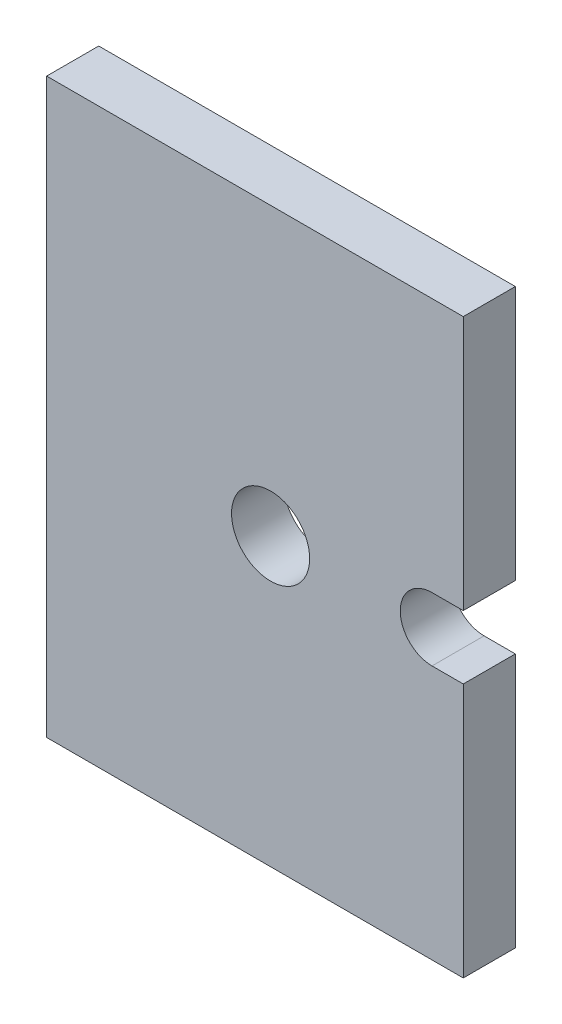
ISO-10303-21;
HEADER;
FILE_DESCRIPTION(('STEP AP214'),'2;1');
FILE_NAME('part.step','',(''),(''),'','','');
FILE_SCHEMA(('AUTOMOTIVE_DESIGN { 1 0 10303 214 1 1 1 1 }'));
ENDSEC;
DATA;
#1=APPLICATION_CONTEXT('core data for automotive mechanical design processes');
#2=APPLICATION_PROTOCOL_DEFINITION('international standard','automotive_design',2000,#1);
#3=PRODUCT_CONTEXT('',#1,'mechanical');
#4=PRODUCT('Part','Part','',(#3));
#5=PRODUCT_RELATED_PRODUCT_CATEGORY('part','',(#4));
#6=PRODUCT_DEFINITION_FORMATION('','',#4);
#7=PRODUCT_DEFINITION_CONTEXT('part definition',#1,'design');
#8=PRODUCT_DEFINITION('design','',#6,#7);
#9=PRODUCT_DEFINITION_SHAPE('','',#8);
#10=(LENGTH_UNIT() NAMED_UNIT(*) SI_UNIT(.MILLI.,.METRE.));
#11=(NAMED_UNIT(*) PLANE_ANGLE_UNIT() SI_UNIT($,.RADIAN.));
#12=(NAMED_UNIT(*) SI_UNIT($,.STERADIAN.) SOLID_ANGLE_UNIT());
#13=UNCERTAINTY_MEASURE_WITH_UNIT(LENGTH_MEASURE(1.E-05),#10,'distance_accuracy_value','');
#14=(GEOMETRIC_REPRESENTATION_CONTEXT(3) GLOBAL_UNCERTAINTY_ASSIGNED_CONTEXT((#13)) GLOBAL_UNIT_ASSIGNED_CONTEXT((#10,
#11,#12)) REPRESENTATION_CONTEXT('',''));
#15=CARTESIAN_POINT('',(0.,0.,0.));
#16=DIRECTION('',(0.,0.,1.));
#17=DIRECTION('',(1.,0.,0.));
#18=AXIS2_PLACEMENT_3D('',#15,#16,#17);
#19=CARTESIAN_POINT('',(-85.,55.,-104.));
#20=DIRECTION('',(0.,1.,0.));
#21=DIRECTION('',(0.,0.,1.));
#22=AXIS2_PLACEMENT_3D('',#19,#20,#21);
#23=PLANE('',#22);
#24=DIRECTION('',(1.,0.,0.));
#25=VECTOR('',#24,1.);
#26=CARTESIAN_POINT('',(-85.,55.,-114.));
#27=LINE('',#26,#25);
#28=CARTESIAN_POINT('',(-85.,55.,-114.));
#29=VERTEX_POINT('',#28);
#30=CARTESIAN_POINT('',(-5.,55.,-114.));
#31=VERTEX_POINT('',#30);
#32=EDGE_CURVE('E133',#29,#31,#27,.T.);
#33=ORIENTED_EDGE('',*,*,#32,.F.);
#34=DIRECTION('',(0.,0.,-1.));
#35=VECTOR('',#34,1.);
#36=CARTESIAN_POINT('',(-85.,55.,-104.));
#37=LINE('',#36,#35);
#38=CARTESIAN_POINT('',(-85.,55.,-104.));
#39=VERTEX_POINT('',#38);
#40=EDGE_CURVE('E11',#39,#29,#37,.T.);
#41=ORIENTED_EDGE('',*,*,#40,.F.);
#42=DIRECTION('',(1.,0.,0.));
#43=VECTOR('',#42,1.);
#44=CARTESIAN_POINT('',(-85.,55.,-104.));
#45=LINE('',#44,#43);
#46=CARTESIAN_POINT('',(-5.,55.,-104.));
#47=VERTEX_POINT('',#46);
#48=EDGE_CURVE('E154',#39,#47,#45,.T.);
#49=ORIENTED_EDGE('',*,*,#48,.T.);
#50=DIRECTION('',(0.,0.,-1.));
#51=VECTOR('',#50,1.);
#52=CARTESIAN_POINT('',(-5.,55.,-104.));
#53=LINE('',#52,#51);
#54=EDGE_CURVE('E39',#47,#31,#53,.T.);
#55=ORIENTED_EDGE('',*,*,#54,.T.);
#56=EDGE_LOOP('',(#33,#41,#49,#55));
#57=FACE_BOUND('',#56,.T.);
#58=ADVANCED_FACE('F36',(#57),#23,.T.);
#59=CARTESIAN_POINT('',(-85.,-55.,-104.));
#60=DIRECTION('',(-1.,0.,0.));
#61=DIRECTION('',(0.,0.,1.));
#62=AXIS2_PLACEMENT_3D('',#59,#60,#61);
#63=PLANE('',#62);
#64=DIRECTION('',(0.,1.,0.));
#65=VECTOR('',#64,1.);
#66=CARTESIAN_POINT('',(-85.,-55.,-114.));
#67=LINE('',#66,#65);
#68=CARTESIAN_POINT('',(-85.,-55.,-114.));
#69=VERTEX_POINT('',#68);
#70=EDGE_CURVE('E152',#69,#29,#67,.T.);
#71=ORIENTED_EDGE('',*,*,#70,.F.);
#72=DIRECTION('',(0.,0.,-1.));
#73=VECTOR('',#72,1.);
#74=CARTESIAN_POINT('',(-85.,-55.,-104.));
#75=LINE('',#74,#73);
#76=CARTESIAN_POINT('',(-85.,-55.,-104.));
#77=VERTEX_POINT('',#76);
#78=EDGE_CURVE('E45',#77,#69,#75,.T.);
#79=ORIENTED_EDGE('',*,*,#78,.F.);
#80=DIRECTION('',(0.,1.,0.));
#81=VECTOR('',#80,1.);
#82=CARTESIAN_POINT('',(-85.,-55.,-104.));
#83=LINE('',#82,#81);
#84=EDGE_CURVE('E123',#77,#39,#83,.T.);
#85=ORIENTED_EDGE('',*,*,#84,.T.);
#86=ORIENTED_EDGE('',*,*,#40,.T.);
#87=EDGE_LOOP('',(#71,#79,#85,#86));
#88=FACE_BOUND('',#87,.T.);
#89=ADVANCED_FACE('F166',(#88),#63,.T.);
#90=CARTESIAN_POINT('',(-5.,-55.,-104.));
#91=DIRECTION('',(0.,-1.,0.));
#92=DIRECTION('',(0.,0.,-1.));
#93=AXIS2_PLACEMENT_3D('',#90,#91,#92);
#94=PLANE('',#93);
#95=DIRECTION('',(-1.,0.,0.));
#96=VECTOR('',#95,1.);
#97=CARTESIAN_POINT('',(-5.,-55.,-114.));
#98=LINE('',#97,#96);
#99=CARTESIAN_POINT('',(-5.,-55.,-114.));
#100=VERTEX_POINT('',#99);
#101=EDGE_CURVE('E110',#100,#69,#98,.T.);
#102=ORIENTED_EDGE('',*,*,#101,.F.);
#103=DIRECTION('',(0.,0.,-1.));
#104=VECTOR('',#103,1.);
#105=CARTESIAN_POINT('',(-5.,-55.,-104.));
#106=LINE('',#105,#104);
#107=CARTESIAN_POINT('',(-5.,-55.,-104.));
#108=VERTEX_POINT('',#107);
#109=EDGE_CURVE('E105',#108,#100,#106,.T.);
#110=ORIENTED_EDGE('',*,*,#109,.F.);
#111=DIRECTION('',(-1.,0.,0.));
#112=VECTOR('',#111,1.);
#113=CARTESIAN_POINT('',(-5.,-55.,-104.));
#114=LINE('',#113,#112);
#115=EDGE_CURVE('E108',#108,#77,#114,.T.);
#116=ORIENTED_EDGE('',*,*,#115,.T.);
#117=ORIENTED_EDGE('',*,*,#78,.T.);
#118=EDGE_LOOP('',(#102,#110,#116,#117));
#119=FACE_BOUND('',#118,.T.);
#120=ADVANCED_FACE('F107',(#119),#94,.T.);
#121=CARTESIAN_POINT('',(-5.,-6.1,-104.));
#122=DIRECTION('',(1.,0.,0.));
#123=DIRECTION('',(0.,0.,-1.));
#124=AXIS2_PLACEMENT_3D('',#121,#122,#123);
#125=PLANE('',#124);
#126=DIRECTION('',(0.,-1.,0.));
#127=VECTOR('',#126,1.);
#128=CARTESIAN_POINT('',(-5.,-6.1,-114.));
#129=LINE('',#128,#127);
#130=CARTESIAN_POINT('',(-5.,-6.1,-114.));
#131=VERTEX_POINT('',#130);
#132=EDGE_CURVE('E149',#131,#100,#129,.T.);
#133=ORIENTED_EDGE('',*,*,#132,.F.);
#134=DIRECTION('',(0.,0.,-1.));
#135=VECTOR('',#134,1.);
#136=CARTESIAN_POINT('',(-5.,-6.1,-104.));
#137=LINE('',#136,#135);
#138=CARTESIAN_POINT('',(-5.,-6.1,-104.));
#139=VERTEX_POINT('',#138);
#140=EDGE_CURVE('E115',#139,#131,#137,.T.);
#141=ORIENTED_EDGE('',*,*,#140,.F.);
#142=DIRECTION('',(0.,-1.,0.));
#143=VECTOR('',#142,1.);
#144=CARTESIAN_POINT('',(-5.,-6.1,-104.));
#145=LINE('',#144,#143);
#146=EDGE_CURVE('E121',#139,#108,#145,.T.);
#147=ORIENTED_EDGE('',*,*,#146,.T.);
#148=ORIENTED_EDGE('',*,*,#109,.T.);
#149=EDGE_LOOP('',(#133,#141,#147,#148));
#150=FACE_BOUND('',#149,.T.);
#151=ADVANCED_FACE('F125',(#150),#125,.T.);
#152=CARTESIAN_POINT('',(-11.,-6.1,-104.));
#153=DIRECTION('',(0.,1.,0.));
#154=DIRECTION('',(-1.,0.,0.));
#155=AXIS2_PLACEMENT_3D('',#152,#153,#154);
#156=PLANE('',#155);
#157=DIRECTION('',(1.,0.,0.));
#158=VECTOR('',#157,1.);
#159=CARTESIAN_POINT('',(-11.,-6.1,-114.));
#160=LINE('',#159,#158);
#161=CARTESIAN_POINT('',(-11.,-6.1,-114.));
#162=VERTEX_POINT('',#161);
#163=EDGE_CURVE('E146',#162,#131,#160,.T.);
#164=ORIENTED_EDGE('',*,*,#163,.F.);
#165=DIRECTION('',(0.,0.,-1.));
#166=VECTOR('',#165,1.);
#167=CARTESIAN_POINT('',(-11.,-6.1,-104.));
#168=LINE('',#167,#166);
#169=CARTESIAN_POINT('',(-11.,-6.1,-104.));
#170=VERTEX_POINT('',#169);
#171=EDGE_CURVE('E158',#170,#162,#168,.T.);
#172=ORIENTED_EDGE('',*,*,#171,.F.);
#173=DIRECTION('',(1.,0.,0.));
#174=VECTOR('',#173,1.);
#175=CARTESIAN_POINT('',(-11.,-6.1,-104.));
#176=LINE('',#175,#174);
#177=EDGE_CURVE('E126',#170,#139,#176,.T.);
#178=ORIENTED_EDGE('',*,*,#177,.T.);
#179=ORIENTED_EDGE('',*,*,#140,.T.);
#180=EDGE_LOOP('',(#164,#172,#178,#179));
#181=FACE_BOUND('',#180,.T.);
#182=ADVANCED_FACE('F180',(#181),#156,.T.);
#183=CARTESIAN_POINT('',(-11.,0.,-104.));
#184=DIRECTION('',(0.,0.,-1.));
#185=DIRECTION('',(0.,1.,0.));
#186=AXIS2_PLACEMENT_3D('',#183,#184,#185);
#187=CYLINDRICAL_SURFACE('',#186,6.10000000000001);
#188=CARTESIAN_POINT('',(-11.,0.,-114.));
#189=DIRECTION('',(0.,0.,1.));
#190=DIRECTION('',(0.,1.,0.));
#191=AXIS2_PLACEMENT_3D('',#188,#189,#190);
#192=CIRCLE('',#191,6.10000000000001);
#193=CARTESIAN_POINT('',(-11.,6.10000000000002,-114.));
#194=VERTEX_POINT('',#193);
#195=EDGE_CURVE('E143',#194,#162,#192,.T.);
#196=ORIENTED_EDGE('',*,*,#195,.F.);
#197=DIRECTION('',(0.,0.,-1.));
#198=VECTOR('',#197,1.);
#199=CARTESIAN_POINT('',(-11.,6.10000000000002,-104.));
#200=LINE('',#199,#198);
#201=CARTESIAN_POINT('',(-11.,6.10000000000002,-104.));
#202=VERTEX_POINT('',#201);
#203=EDGE_CURVE('E160',#202,#194,#200,.T.);
#204=ORIENTED_EDGE('',*,*,#203,.F.);
#205=CARTESIAN_POINT('',(-11.,0.,-104.));
#206=DIRECTION('',(0.,0.,1.));
#207=DIRECTION('',(0.,1.,0.));
#208=AXIS2_PLACEMENT_3D('',#205,#206,#207);
#209=CIRCLE('',#208,6.10000000000001);
#210=EDGE_CURVE('E128',#202,#170,#209,.T.);
#211=ORIENTED_EDGE('',*,*,#210,.T.);
#212=ORIENTED_EDGE('',*,*,#171,.T.);
#213=EDGE_LOOP('',(#196,#204,#211,#212));
#214=FACE_BOUND('',#213,.T.);
#215=ADVANCED_FACE('F183',(#214),#187,.F.);
#216=CARTESIAN_POINT('',(-5.,6.10000000000001,-104.));
#217=DIRECTION('',(0.,-1.,0.));
#218=DIRECTION('',(1.,0.,0.));
#219=AXIS2_PLACEMENT_3D('',#216,#217,#218);
#220=PLANE('',#219);
#221=DIRECTION('',(-1.,0.,0.));
#222=VECTOR('',#221,1.);
#223=CARTESIAN_POINT('',(-5.,6.10000000000001,-114.));
#224=LINE('',#223,#222);
#225=CARTESIAN_POINT('',(-5.,6.10000000000001,-114.));
#226=VERTEX_POINT('',#225);
#227=EDGE_CURVE('E140',#226,#194,#224,.T.);
#228=ORIENTED_EDGE('',*,*,#227,.F.);
#229=DIRECTION('',(0.,0.,-1.));
#230=VECTOR('',#229,1.);
#231=CARTESIAN_POINT('',(-5.,6.10000000000001,-104.));
#232=LINE('',#231,#230);
#233=CARTESIAN_POINT('',(-5.,6.10000000000001,-104.));
#234=VERTEX_POINT('',#233);
#235=EDGE_CURVE('E161',#234,#226,#232,.T.);
#236=ORIENTED_EDGE('',*,*,#235,.F.);
#237=DIRECTION('',(-1.,0.,0.));
#238=VECTOR('',#237,1.);
#239=CARTESIAN_POINT('',(-5.,6.10000000000001,-104.));
#240=LINE('',#239,#238);
#241=EDGE_CURVE('E221',#234,#202,#240,.T.);
#242=ORIENTED_EDGE('',*,*,#241,.T.);
#243=ORIENTED_EDGE('',*,*,#203,.T.);
#244=EDGE_LOOP('',(#228,#236,#242,#243));
#245=FACE_BOUND('',#244,.T.);
#246=ADVANCED_FACE('F187',(#245),#220,.T.);
#247=CARTESIAN_POINT('',(-5.,55.,-104.));
#248=DIRECTION('',(1.,0.,0.));
#249=DIRECTION('',(0.,0.,-1.));
#250=AXIS2_PLACEMENT_3D('',#247,#248,#249);
#251=PLANE('',#250);
#252=DIRECTION('',(0.,-1.,0.));
#253=VECTOR('',#252,1.);
#254=CARTESIAN_POINT('',(-5.,55.,-114.));
#255=LINE('',#254,#253);
#256=EDGE_CURVE('E136',#31,#226,#255,.T.);
#257=ORIENTED_EDGE('',*,*,#256,.F.);
#258=ORIENTED_EDGE('',*,*,#54,.F.);
#259=DIRECTION('',(0.,-1.,0.));
#260=VECTOR('',#259,1.);
#261=CARTESIAN_POINT('',(-5.,55.,-104.));
#262=LINE('',#261,#260);
#263=EDGE_CURVE('E219',#47,#234,#262,.T.);
#264=ORIENTED_EDGE('',*,*,#263,.T.);
#265=ORIENTED_EDGE('',*,*,#235,.T.);
#266=EDGE_LOOP('',(#257,#258,#264,#265));
#267=FACE_BOUND('',#266,.T.);
#268=ADVANCED_FACE('F163',(#267),#251,.T.);
#269=CARTESIAN_POINT('',(-11.,0.,-104.));
#270=DIRECTION('',(0.,0.,-1.));
#271=DIRECTION('',(0.,1.,0.));
#272=AXIS2_PLACEMENT_3D('',#269,#270,#271);
#273=PLANE('',#272);
#274=CARTESIAN_POINT('',(-42.0000000000001,0.,-104.));
#275=DIRECTION('',(0.,0.,-1.));
#276=DIRECTION('',(0.,1.,0.));
#277=AXIS2_PLACEMENT_3D('',#274,#275,#276);
#278=CIRCLE('',#277,7.5);
#279=CARTESIAN_POINT('',(-42.0000000000001,7.5,-104.));
#280=VERTEX_POINT('',#279);
#281=EDGE_CURVE('E137',#280,#280,#278,.T.);
#282=ORIENTED_EDGE('',*,*,#281,.T.);
#283=EDGE_LOOP('',(#282));
#284=FACE_BOUND('',#283,.T.);
#285=ORIENTED_EDGE('',*,*,#48,.F.);
#286=ORIENTED_EDGE('',*,*,#84,.F.);
#287=ORIENTED_EDGE('',*,*,#115,.F.);
#288=ORIENTED_EDGE('',*,*,#146,.F.);
#289=ORIENTED_EDGE('',*,*,#177,.F.);
#290=ORIENTED_EDGE('',*,*,#210,.F.);
#291=ORIENTED_EDGE('',*,*,#241,.F.);
#292=ORIENTED_EDGE('',*,*,#263,.F.);
#293=EDGE_LOOP('',(#285,#286,#287,#288,#289,#290,#291,#292));
#294=FACE_BOUND('',#293,.T.);
#295=ADVANCED_FACE('F119',(#284,#294),#273,.F.);
#296=CARTESIAN_POINT('',(-11.,0.,-114.));
#297=DIRECTION('',(0.,0.,-1.));
#298=DIRECTION('',(0.,1.,0.));
#299=AXIS2_PLACEMENT_3D('',#296,#297,#298);
#300=PLANE('',#299);
#301=CARTESIAN_POINT('',(-42.0000000000001,0.,-114.));
#302=DIRECTION('',(0.,0.,-1.));
#303=DIRECTION('',(0.,1.,0.));
#304=AXIS2_PLACEMENT_3D('',#301,#302,#303);
#305=CIRCLE('',#304,7.5);
#306=CARTESIAN_POINT('',(-42.0000000000001,7.5,-114.));
#307=VERTEX_POINT('',#306);
#308=EDGE_CURVE('E214',#307,#307,#305,.T.);
#309=ORIENTED_EDGE('',*,*,#308,.F.);
#310=EDGE_LOOP('',(#309));
#311=FACE_BOUND('',#310,.T.);
#312=ORIENTED_EDGE('',*,*,#32,.T.);
#313=ORIENTED_EDGE('',*,*,#256,.T.);
#314=ORIENTED_EDGE('',*,*,#227,.T.);
#315=ORIENTED_EDGE('',*,*,#195,.T.);
#316=ORIENTED_EDGE('',*,*,#163,.T.);
#317=ORIENTED_EDGE('',*,*,#132,.T.);
#318=ORIENTED_EDGE('',*,*,#101,.T.);
#319=ORIENTED_EDGE('',*,*,#70,.T.);
#320=EDGE_LOOP('',(#312,#313,#314,#315,#316,#317,#318,#319));
#321=FACE_BOUND('',#320,.T.);
#322=ADVANCED_FACE('F165',(#311,#321),#300,.T.);
#323=CARTESIAN_POINT('',(-42.0000000000001,0.,-104.));
#324=DIRECTION('',(0.,0.,-1.));
#325=DIRECTION('',(0.,1.,0.));
#326=AXIS2_PLACEMENT_3D('',#323,#324,#325);
#327=CYLINDRICAL_SURFACE('',#326,7.5);
#328=ORIENTED_EDGE('',*,*,#281,.F.);
#329=EDGE_LOOP('',(#328));
#330=FACE_BOUND('',#329,.T.);
#331=ORIENTED_EDGE('',*,*,#308,.T.);
#332=EDGE_LOOP('',(#331));
#333=FACE_BOUND('',#332,.T.);
#334=ADVANCED_FACE('F201',(#330,#333),#327,.F.);
#335=CLOSED_SHELL('',(#58,#89,#120,#151,#182,#215,#246,#268,#295,#322,#334));
#336=MANIFOLD_SOLID_BREP('B2',#335);
#337=ADVANCED_BREP_SHAPE_REPRESENTATION('',(#18,#336),#14);
#338=SHAPE_DEFINITION_REPRESENTATION(#9,#337);
ENDSEC;
END-ISO-10303-21;
